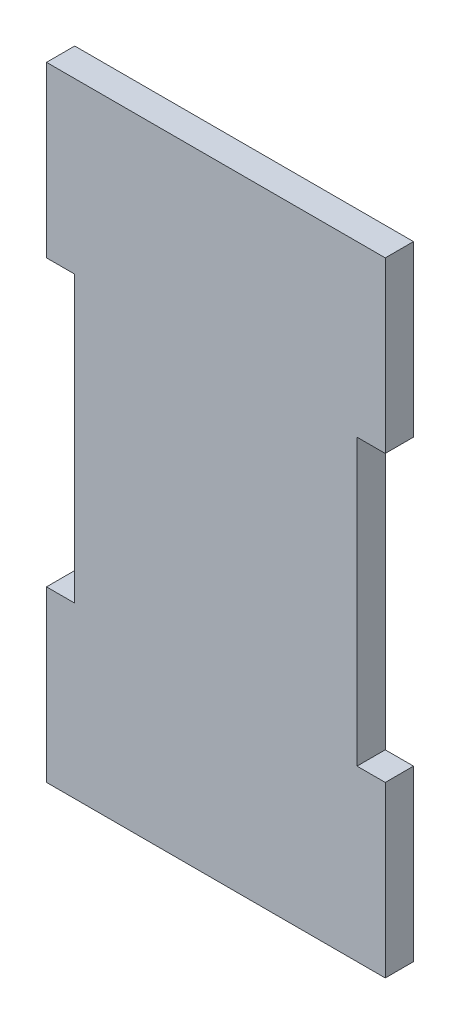
ISO-10303-21;
HEADER;
FILE_DESCRIPTION(('STEP AP214'),'2;1');
FILE_NAME('part.step','',(''),(''),'','','');
FILE_SCHEMA(('AUTOMOTIVE_DESIGN { 1 0 10303 214 1 1 1 1 }'));
ENDSEC;
DATA;
#1=APPLICATION_CONTEXT('core data for automotive mechanical design processes');
#2=APPLICATION_PROTOCOL_DEFINITION('international standard','automotive_design',2000,#1);
#3=PRODUCT_CONTEXT('',#1,'mechanical');
#4=PRODUCT('Part','Part','',(#3));
#5=PRODUCT_RELATED_PRODUCT_CATEGORY('part','',(#4));
#6=PRODUCT_DEFINITION_FORMATION('','',#4);
#7=PRODUCT_DEFINITION_CONTEXT('part definition',#1,'design');
#8=PRODUCT_DEFINITION('design','',#6,#7);
#9=PRODUCT_DEFINITION_SHAPE('','',#8);
#10=(LENGTH_UNIT() NAMED_UNIT(*) SI_UNIT(.MILLI.,.METRE.));
#11=(NAMED_UNIT(*) PLANE_ANGLE_UNIT() SI_UNIT($,.RADIAN.));
#12=(NAMED_UNIT(*) SI_UNIT($,.STERADIAN.) SOLID_ANGLE_UNIT());
#13=UNCERTAINTY_MEASURE_WITH_UNIT(LENGTH_MEASURE(1.E-05),#10,'distance_accuracy_value','');
#14=(GEOMETRIC_REPRESENTATION_CONTEXT(3) GLOBAL_UNCERTAINTY_ASSIGNED_CONTEXT((#13)) GLOBAL_UNIT_ASSIGNED_CONTEXT((#10,
#11,#12)) REPRESENTATION_CONTEXT('',''));
#15=CARTESIAN_POINT('',(0.,0.,0.));
#16=DIRECTION('',(0.,0.,1.));
#17=DIRECTION('',(1.,0.,0.));
#18=AXIS2_PLACEMENT_3D('',#15,#16,#17);
#19=CARTESIAN_POINT('',(0.,264.785050797916,3.175));
#20=DIRECTION('',(0.,-1.,0.));
#21=DIRECTION('',(0.,0.,-1.));
#22=AXIS2_PLACEMENT_3D('',#19,#20,#21);
#23=PLANE('',#22);
#24=DIRECTION('',(-1.,0.,0.));
#25=VECTOR('',#24,1.);
#26=CARTESIAN_POINT('',(0.,264.785050797916,0.));
#27=LINE('',#26,#25);
#28=CARTESIAN_POINT('',(0.,264.785050797916,0.));
#29=VERTEX_POINT('',#28);
#30=CARTESIAN_POINT('',(-3.17500000000001,264.785050797916,0.));
#31=VERTEX_POINT('',#30);
#32=EDGE_CURVE('E156',#29,#31,#27,.T.);
#33=ORIENTED_EDGE('',*,*,#32,.T.);
#34=DIRECTION('',(0.,0.,-1.));
#35=VECTOR('',#34,1.);
#36=CARTESIAN_POINT('',(-3.17500000000001,264.785050797916,3.175));
#37=LINE('',#36,#35);
#38=CARTESIAN_POINT('',(-3.17500000000001,264.785050797916,3.175));
#39=VERTEX_POINT('',#38);
#40=EDGE_CURVE('E11',#39,#31,#37,.T.);
#41=ORIENTED_EDGE('',*,*,#40,.F.);
#42=DIRECTION('',(-1.,0.,0.));
#43=VECTOR('',#42,1.);
#44=CARTESIAN_POINT('',(0.,264.785050797916,3.175));
#45=LINE('',#44,#43);
#46=CARTESIAN_POINT('',(0.,264.785050797916,3.175));
#47=VERTEX_POINT('',#46);
#48=EDGE_CURVE('E184',#47,#39,#45,.T.);
#49=ORIENTED_EDGE('',*,*,#48,.F.);
#50=DIRECTION('',(0.,0.,-1.));
#51=VECTOR('',#50,1.);
#52=CARTESIAN_POINT('',(0.,264.785050797916,3.175));
#53=LINE('',#52,#51);
#54=EDGE_CURVE('E155',#47,#29,#53,.T.);
#55=ORIENTED_EDGE('',*,*,#54,.T.);
#56=EDGE_LOOP('',(#33,#41,#49,#55));
#57=FACE_BOUND('',#56,.T.);
#58=ADVANCED_FACE('F35',(#57),#23,.F.);
#59=CARTESIAN_POINT('',(-3.17500000000001,0.,3.175));
#60=DIRECTION('',(-1.,0.,0.));
#61=DIRECTION('',(0.,0.,1.));
#62=AXIS2_PLACEMENT_3D('',#59,#60,#61);
#63=PLANE('',#62);
#64=DIRECTION('',(0.,1.,0.));
#65=VECTOR('',#64,1.);
#66=CARTESIAN_POINT('',(-3.17500000000001,0.,0.));
#67=LINE('',#66,#65);
#68=CARTESIAN_POINT('',(-3.17500000000001,296.82600973079,0.));
#69=VERTEX_POINT('',#68);
#70=EDGE_CURVE('E159',#31,#69,#67,.T.);
#71=ORIENTED_EDGE('',*,*,#70,.T.);
#72=DIRECTION('',(0.,0.,-1.));
#73=VECTOR('',#72,1.);
#74=CARTESIAN_POINT('',(-3.17500000000001,296.82600973079,3.17500000000001));
#75=LINE('',#74,#73);
#76=CARTESIAN_POINT('',(-3.17500000000001,296.82600973079,3.17500000000001));
#77=VERTEX_POINT('',#76);
#78=EDGE_CURVE('E43',#77,#69,#75,.T.);
#79=ORIENTED_EDGE('',*,*,#78,.F.);
#80=DIRECTION('',(0.,1.,0.));
#81=VECTOR('',#80,1.);
#82=CARTESIAN_POINT('',(-3.17500000000001,0.,3.175));
#83=LINE('',#82,#81);
#84=EDGE_CURVE('E105',#39,#77,#83,.T.);
#85=ORIENTED_EDGE('',*,*,#84,.F.);
#86=ORIENTED_EDGE('',*,*,#40,.T.);
#87=EDGE_LOOP('',(#71,#79,#85,#86));
#88=FACE_BOUND('',#87,.T.);
#89=ADVANCED_FACE('F207',(#88),#63,.F.);
#90=CARTESIAN_POINT('',(0.,296.82600973079,3.17500000000001));
#91=DIRECTION('',(0.,-1.,0.));
#92=DIRECTION('',(0.,0.,-1.));
#93=AXIS2_PLACEMENT_3D('',#90,#91,#92);
#94=PLANE('',#93);
#95=DIRECTION('',(-1.,0.,0.));
#96=VECTOR('',#95,1.);
#97=CARTESIAN_POINT('',(0.,296.82600973079,0.));
#98=LINE('',#97,#96);
#99=CARTESIAN_POINT('',(0.,296.82600973079,0.));
#100=VERTEX_POINT('',#99);
#101=EDGE_CURVE('E162',#100,#69,#98,.T.);
#102=ORIENTED_EDGE('',*,*,#101,.F.);
#103=DIRECTION('',(0.,0.,-1.));
#104=VECTOR('',#103,1.);
#105=CARTESIAN_POINT('',(0.,296.82600973079,3.17500000000001));
#106=LINE('',#105,#104);
#107=CARTESIAN_POINT('',(0.,296.82600973079,3.17500000000001));
#108=VERTEX_POINT('',#107);
#109=EDGE_CURVE('E200',#108,#100,#106,.T.);
#110=ORIENTED_EDGE('',*,*,#109,.F.);
#111=DIRECTION('',(-1.,0.,0.));
#112=VECTOR('',#111,1.);
#113=CARTESIAN_POINT('',(0.,296.82600973079,3.17500000000001));
#114=LINE('',#113,#112);
#115=EDGE_CURVE('E206',#108,#77,#114,.T.);
#116=ORIENTED_EDGE('',*,*,#115,.T.);
#117=ORIENTED_EDGE('',*,*,#78,.T.);
#118=EDGE_LOOP('',(#102,#110,#116,#117));
#119=FACE_BOUND('',#118,.T.);
#120=ADVANCED_FACE('F204',(#119),#94,.T.);
#121=CARTESIAN_POINT('',(0.,0.,3.175));
#122=DIRECTION('',(1.,0.,0.));
#123=DIRECTION('',(0.,0.,-1.));
#124=AXIS2_PLACEMENT_3D('',#121,#122,#123);
#125=PLANE('',#124);
#126=DIRECTION('',(0.,-1.,0.));
#127=VECTOR('',#126,1.);
#128=CARTESIAN_POINT('',(0.,0.,0.));
#129=LINE('',#128,#127);
#130=CARTESIAN_POINT('',(0.,315.87600973079,0.));
#131=VERTEX_POINT('',#130);
#132=EDGE_CURVE('E165',#131,#100,#129,.T.);
#133=ORIENTED_EDGE('',*,*,#132,.F.);
#134=DIRECTION('',(0.,0.,-1.));
#135=VECTOR('',#134,1.);
#136=CARTESIAN_POINT('',(0.,315.87600973079,3.17500000000001));
#137=LINE('',#136,#135);
#138=CARTESIAN_POINT('',(0.,315.87600973079,3.17500000000001));
#139=VERTEX_POINT('',#138);
#140=EDGE_CURVE('E198',#139,#131,#137,.T.);
#141=ORIENTED_EDGE('',*,*,#140,.F.);
#142=DIRECTION('',(0.,-1.,0.));
#143=VECTOR('',#142,1.);
#144=CARTESIAN_POINT('',(0.,0.,3.175));
#145=LINE('',#144,#143);
#146=EDGE_CURVE('E219',#139,#108,#145,.T.);
#147=ORIENTED_EDGE('',*,*,#146,.T.);
#148=ORIENTED_EDGE('',*,*,#109,.T.);
#149=EDGE_LOOP('',(#133,#141,#147,#148));
#150=FACE_BOUND('',#149,.T.);
#151=ADVANCED_FACE('F216',(#150),#125,.T.);
#152=CARTESIAN_POINT('',(0.,315.87600973079,3.17500000000001));
#153=DIRECTION('',(0.,1.,0.));
#154=DIRECTION('',(0.,0.,1.));
#155=AXIS2_PLACEMENT_3D('',#152,#153,#154);
#156=PLANE('',#155);
#157=DIRECTION('',(1.,0.,0.));
#158=VECTOR('',#157,1.);
#159=CARTESIAN_POINT('',(0.,315.87600973079,0.));
#160=LINE('',#159,#158);
#161=CARTESIAN_POINT('',(-38.1,315.87600973079,0.));
#162=VERTEX_POINT('',#161);
#163=EDGE_CURVE('E168',#162,#131,#160,.T.);
#164=ORIENTED_EDGE('',*,*,#163,.F.);
#165=DIRECTION('',(0.,0.,-1.));
#166=VECTOR('',#165,1.);
#167=CARTESIAN_POINT('',(-38.1,315.87600973079,3.17500000000001));
#168=LINE('',#167,#166);
#169=CARTESIAN_POINT('',(-38.1,315.87600973079,3.17500000000001));
#170=VERTEX_POINT('',#169);
#171=EDGE_CURVE('E196',#170,#162,#168,.T.);
#172=ORIENTED_EDGE('',*,*,#171,.F.);
#173=DIRECTION('',(1.,0.,0.));
#174=VECTOR('',#173,1.);
#175=CARTESIAN_POINT('',(0.,315.87600973079,3.17500000000001));
#176=LINE('',#175,#174);
#177=EDGE_CURVE('E223',#170,#139,#176,.T.);
#178=ORIENTED_EDGE('',*,*,#177,.T.);
#179=ORIENTED_EDGE('',*,*,#140,.T.);
#180=EDGE_LOOP('',(#164,#172,#178,#179));
#181=FACE_BOUND('',#180,.T.);
#182=ADVANCED_FACE('F265',(#181),#156,.T.);
#183=CARTESIAN_POINT('',(-38.1,0.,3.175));
#184=DIRECTION('',(1.,0.,0.));
#185=DIRECTION('',(0.,0.,-1.));
#186=AXIS2_PLACEMENT_3D('',#183,#184,#185);
#187=PLANE('',#186);
#188=DIRECTION('',(0.,-1.,0.));
#189=VECTOR('',#188,1.);
#190=CARTESIAN_POINT('',(-38.1,0.,0.));
#191=LINE('',#190,#189);
#192=CARTESIAN_POINT('',(-38.1,296.82600973079,0.));
#193=VERTEX_POINT('',#192);
#194=EDGE_CURVE('E171',#162,#193,#191,.T.);
#195=ORIENTED_EDGE('',*,*,#194,.T.);
#196=DIRECTION('',(0.,0.,-1.));
#197=VECTOR('',#196,1.);
#198=CARTESIAN_POINT('',(-38.1,296.82600973079,3.17499999999999));
#199=LINE('',#198,#197);
#200=CARTESIAN_POINT('',(-38.1,296.82600973079,3.17499999999999));
#201=VERTEX_POINT('',#200);
#202=EDGE_CURVE('E193',#201,#193,#199,.T.);
#203=ORIENTED_EDGE('',*,*,#202,.F.);
#204=DIRECTION('',(0.,-1.,0.));
#205=VECTOR('',#204,1.);
#206=CARTESIAN_POINT('',(-38.1,0.,3.175));
#207=LINE('',#206,#205);
#208=EDGE_CURVE('E229',#170,#201,#207,.T.);
#209=ORIENTED_EDGE('',*,*,#208,.F.);
#210=ORIENTED_EDGE('',*,*,#171,.T.);
#211=EDGE_LOOP('',(#195,#203,#209,#210));
#212=FACE_BOUND('',#211,.T.);
#213=ADVANCED_FACE('F268',(#212),#187,.F.);
#214=CARTESIAN_POINT('',(0.,296.82600973079,3.17499999999999));
#215=DIRECTION('',(0.,1.,0.));
#216=DIRECTION('',(0.,0.,1.));
#217=AXIS2_PLACEMENT_3D('',#214,#215,#216);
#218=PLANE('',#217);
#219=DIRECTION('',(1.,0.,0.));
#220=VECTOR('',#219,1.);
#221=CARTESIAN_POINT('',(0.,296.82600973079,0.));
#222=LINE('',#221,#220);
#223=CARTESIAN_POINT('',(-34.925,296.82600973079,0.));
#224=VERTEX_POINT('',#223);
#225=EDGE_CURVE('E173',#193,#224,#222,.T.);
#226=ORIENTED_EDGE('',*,*,#225,.T.);
#227=DIRECTION('',(0.,0.,-1.));
#228=VECTOR('',#227,1.);
#229=CARTESIAN_POINT('',(-34.925,296.82600973079,3.17499999999999));
#230=LINE('',#229,#228);
#231=CARTESIAN_POINT('',(-34.925,296.82600973079,3.17499999999999));
#232=VERTEX_POINT('',#231);
#233=EDGE_CURVE('E190',#232,#224,#230,.T.);
#234=ORIENTED_EDGE('',*,*,#233,.F.);
#235=DIRECTION('',(1.,0.,0.));
#236=VECTOR('',#235,1.);
#237=CARTESIAN_POINT('',(0.,296.82600973079,3.17499999999999));
#238=LINE('',#237,#236);
#239=EDGE_CURVE('E231',#201,#232,#238,.T.);
#240=ORIENTED_EDGE('',*,*,#239,.F.);
#241=ORIENTED_EDGE('',*,*,#202,.T.);
#242=EDGE_LOOP('',(#226,#234,#240,#241));
#243=FACE_BOUND('',#242,.T.);
#244=ADVANCED_FACE('F272',(#243),#218,.F.);
#245=CARTESIAN_POINT('',(-34.925,0.,3.175));
#246=DIRECTION('',(1.,0.,0.));
#247=DIRECTION('',(0.,0.,-1.));
#248=AXIS2_PLACEMENT_3D('',#245,#246,#247);
#249=PLANE('',#248);
#250=DIRECTION('',(0.,-1.,0.));
#251=VECTOR('',#250,1.);
#252=CARTESIAN_POINT('',(-34.925,0.,0.));
#253=LINE('',#252,#251);
#254=CARTESIAN_POINT('',(-34.925,264.785050797916,0.));
#255=VERTEX_POINT('',#254);
#256=EDGE_CURVE('E175',#224,#255,#253,.T.);
#257=ORIENTED_EDGE('',*,*,#256,.T.);
#258=DIRECTION('',(0.,0.,-1.));
#259=VECTOR('',#258,1.);
#260=CARTESIAN_POINT('',(-34.925,264.785050797916,3.17500000000001));
#261=LINE('',#260,#259);
#262=CARTESIAN_POINT('',(-34.925,264.785050797916,3.17500000000001));
#263=VERTEX_POINT('',#262);
#264=EDGE_CURVE('E188',#263,#255,#261,.T.);
#265=ORIENTED_EDGE('',*,*,#264,.F.);
#266=DIRECTION('',(0.,-1.,0.));
#267=VECTOR('',#266,1.);
#268=CARTESIAN_POINT('',(-34.925,0.,3.175));
#269=LINE('',#268,#267);
#270=EDGE_CURVE('E150',#232,#263,#269,.T.);
#271=ORIENTED_EDGE('',*,*,#270,.F.);
#272=ORIENTED_EDGE('',*,*,#233,.T.);
#273=EDGE_LOOP('',(#257,#265,#271,#272));
#274=FACE_BOUND('',#273,.T.);
#275=ADVANCED_FACE('F237',(#274),#249,.F.);
#276=CARTESIAN_POINT('',(0.,264.785050797916,3.17500000000001));
#277=DIRECTION('',(0.,1.,0.));
#278=DIRECTION('',(0.,0.,1.));
#279=AXIS2_PLACEMENT_3D('',#276,#277,#278);
#280=PLANE('',#279);
#281=DIRECTION('',(1.,0.,0.));
#282=VECTOR('',#281,1.);
#283=CARTESIAN_POINT('',(0.,264.785050797916,0.));
#284=LINE('',#283,#282);
#285=CARTESIAN_POINT('',(-38.1,264.785050797916,0.));
#286=VERTEX_POINT('',#285);
#287=EDGE_CURVE('E178',#286,#255,#284,.T.);
#288=ORIENTED_EDGE('',*,*,#287,.F.);
#289=DIRECTION('',(0.,0.,-1.));
#290=VECTOR('',#289,1.);
#291=CARTESIAN_POINT('',(-38.1,264.785050797916,3.17500000000001));
#292=LINE('',#291,#290);
#293=CARTESIAN_POINT('',(-38.1,264.785050797916,3.17500000000001));
#294=VERTEX_POINT('',#293);
#295=EDGE_CURVE('E139',#294,#286,#292,.T.);
#296=ORIENTED_EDGE('',*,*,#295,.F.);
#297=DIRECTION('',(1.,0.,0.));
#298=VECTOR('',#297,1.);
#299=CARTESIAN_POINT('',(0.,264.785050797916,3.17500000000001));
#300=LINE('',#299,#298);
#301=EDGE_CURVE('E148',#294,#263,#300,.T.);
#302=ORIENTED_EDGE('',*,*,#301,.T.);
#303=ORIENTED_EDGE('',*,*,#264,.T.);
#304=EDGE_LOOP('',(#288,#296,#302,#303));
#305=FACE_BOUND('',#304,.T.);
#306=ADVANCED_FACE('F241',(#305),#280,.T.);
#307=CARTESIAN_POINT('',(-38.1,0.,3.175));
#308=DIRECTION('',(-1.,0.,0.));
#309=DIRECTION('',(0.,0.,1.));
#310=AXIS2_PLACEMENT_3D('',#307,#308,#309);
#311=PLANE('',#310);
#312=DIRECTION('',(0.,1.,0.));
#313=VECTOR('',#312,1.);
#314=CARTESIAN_POINT('',(-38.1,0.,0.));
#315=LINE('',#314,#313);
#316=CARTESIAN_POINT('',(-38.1,245.735050797917,0.));
#317=VERTEX_POINT('',#316);
#318=EDGE_CURVE('E138',#317,#286,#315,.T.);
#319=ORIENTED_EDGE('',*,*,#318,.F.);
#320=DIRECTION('',(0.,0.,-1.));
#321=VECTOR('',#320,1.);
#322=CARTESIAN_POINT('',(-38.1,245.735050797917,3.17499999999999));
#323=LINE('',#322,#321);
#324=CARTESIAN_POINT('',(-38.1,245.735050797917,3.17499999999999));
#325=VERTEX_POINT('',#324);
#326=EDGE_CURVE('E132',#325,#317,#323,.T.);
#327=ORIENTED_EDGE('',*,*,#326,.F.);
#328=DIRECTION('',(0.,1.,0.));
#329=VECTOR('',#328,1.);
#330=CARTESIAN_POINT('',(-38.1,0.,3.175));
#331=LINE('',#330,#329);
#332=EDGE_CURVE('E136',#325,#294,#331,.T.);
#333=ORIENTED_EDGE('',*,*,#332,.T.);
#334=ORIENTED_EDGE('',*,*,#295,.T.);
#335=EDGE_LOOP('',(#319,#327,#333,#334));
#336=FACE_BOUND('',#335,.T.);
#337=ADVANCED_FACE('F134',(#336),#311,.T.);
#338=CARTESIAN_POINT('',(0.,245.735050797917,3.17499999999999));
#339=DIRECTION('',(0.,1.,0.));
#340=DIRECTION('',(0.,0.,1.));
#341=AXIS2_PLACEMENT_3D('',#338,#339,#340);
#342=PLANE('',#341);
#343=DIRECTION('',(1.,0.,0.));
#344=VECTOR('',#343,1.);
#345=CARTESIAN_POINT('',(0.,245.735050797917,0.));
#346=LINE('',#345,#344);
#347=CARTESIAN_POINT('',(0.,245.735050797917,0.));
#348=VERTEX_POINT('',#347);
#349=EDGE_CURVE('E91',#317,#348,#346,.T.);
#350=ORIENTED_EDGE('',*,*,#349,.T.);
#351=DIRECTION('',(0.,0.,-1.));
#352=VECTOR('',#351,1.);
#353=CARTESIAN_POINT('',(0.,245.735050797917,3.17499999999999));
#354=LINE('',#353,#352);
#355=CARTESIAN_POINT('',(0.,245.735050797917,3.17499999999999));
#356=VERTEX_POINT('',#355);
#357=EDGE_CURVE('E140',#356,#348,#354,.T.);
#358=ORIENTED_EDGE('',*,*,#357,.F.);
#359=DIRECTION('',(1.,0.,0.));
#360=VECTOR('',#359,1.);
#361=CARTESIAN_POINT('',(0.,245.735050797917,3.17499999999999));
#362=LINE('',#361,#360);
#363=EDGE_CURVE('E142',#325,#356,#362,.T.);
#364=ORIENTED_EDGE('',*,*,#363,.F.);
#365=ORIENTED_EDGE('',*,*,#326,.T.);
#366=EDGE_LOOP('',(#350,#358,#364,#365));
#367=FACE_BOUND('',#366,.T.);
#368=ADVANCED_FACE('F143',(#367),#342,.F.);
#369=CARTESIAN_POINT('',(0.,0.,3.175));
#370=DIRECTION('',(-1.,0.,0.));
#371=DIRECTION('',(0.,0.,1.));
#372=AXIS2_PLACEMENT_3D('',#369,#370,#371);
#373=PLANE('',#372);
#374=DIRECTION('',(0.,1.,0.));
#375=VECTOR('',#374,1.);
#376=CARTESIAN_POINT('',(0.,0.,0.));
#377=LINE('',#376,#375);
#378=EDGE_CURVE('E97',#348,#29,#377,.T.);
#379=ORIENTED_EDGE('',*,*,#378,.T.);
#380=ORIENTED_EDGE('',*,*,#54,.F.);
#381=DIRECTION('',(0.,1.,0.));
#382=VECTOR('',#381,1.);
#383=CARTESIAN_POINT('',(0.,0.,3.175));
#384=LINE('',#383,#382);
#385=EDGE_CURVE('E51',#356,#47,#384,.T.);
#386=ORIENTED_EDGE('',*,*,#385,.F.);
#387=ORIENTED_EDGE('',*,*,#357,.T.);
#388=EDGE_LOOP('',(#379,#380,#386,#387));
#389=FACE_BOUND('',#388,.T.);
#390=ADVANCED_FACE('F244',(#389),#373,.F.);
#391=CARTESIAN_POINT('',(0.,0.,3.175));
#392=DIRECTION('',(0.,0.,1.));
#393=DIRECTION('',(1.,0.,0.));
#394=AXIS2_PLACEMENT_3D('',#391,#392,#393);
#395=PLANE('',#394);
#396=ORIENTED_EDGE('',*,*,#48,.T.);
#397=ORIENTED_EDGE('',*,*,#84,.T.);
#398=ORIENTED_EDGE('',*,*,#115,.F.);
#399=ORIENTED_EDGE('',*,*,#146,.F.);
#400=ORIENTED_EDGE('',*,*,#177,.F.);
#401=ORIENTED_EDGE('',*,*,#208,.T.);
#402=ORIENTED_EDGE('',*,*,#239,.T.);
#403=ORIENTED_EDGE('',*,*,#270,.T.);
#404=ORIENTED_EDGE('',*,*,#301,.F.);
#405=ORIENTED_EDGE('',*,*,#332,.F.);
#406=ORIENTED_EDGE('',*,*,#363,.T.);
#407=ORIENTED_EDGE('',*,*,#385,.T.);
#408=EDGE_LOOP('',(#396,#397,#398,#399,#400,#401,#402,#403,#404,#405,#406,#407));
#409=FACE_BOUND('',#408,.T.);
#410=ADVANCED_FACE('F146',(#409),#395,.T.);
#411=CARTESIAN_POINT('',(0.,0.,0.));
#412=DIRECTION('',(0.,0.,1.));
#413=DIRECTION('',(1.,0.,0.));
#414=AXIS2_PLACEMENT_3D('',#411,#412,#413);
#415=PLANE('',#414);
#416=ORIENTED_EDGE('',*,*,#32,.F.);
#417=ORIENTED_EDGE('',*,*,#378,.F.);
#418=ORIENTED_EDGE('',*,*,#349,.F.);
#419=ORIENTED_EDGE('',*,*,#318,.T.);
#420=ORIENTED_EDGE('',*,*,#287,.T.);
#421=ORIENTED_EDGE('',*,*,#256,.F.);
#422=ORIENTED_EDGE('',*,*,#225,.F.);
#423=ORIENTED_EDGE('',*,*,#194,.F.);
#424=ORIENTED_EDGE('',*,*,#163,.T.);
#425=ORIENTED_EDGE('',*,*,#132,.T.);
#426=ORIENTED_EDGE('',*,*,#101,.T.);
#427=ORIENTED_EDGE('',*,*,#70,.F.);
#428=EDGE_LOOP('',(#416,#417,#418,#419,#420,#421,#422,#423,#424,#425,#426,#427));
#429=FACE_BOUND('',#428,.T.);
#430=ADVANCED_FACE('F211',(#429),#415,.F.);
#431=CLOSED_SHELL('',(#58,#89,#120,#151,#182,#213,#244,#275,#306,#337,#368,#390,#410,#430));
#432=MANIFOLD_SOLID_BREP('B2',#431);
#433=ADVANCED_BREP_SHAPE_REPRESENTATION('',(#18,#432),#14);
#434=SHAPE_DEFINITION_REPRESENTATION(#9,#433);
ENDSEC;
END-ISO-10303-21;
